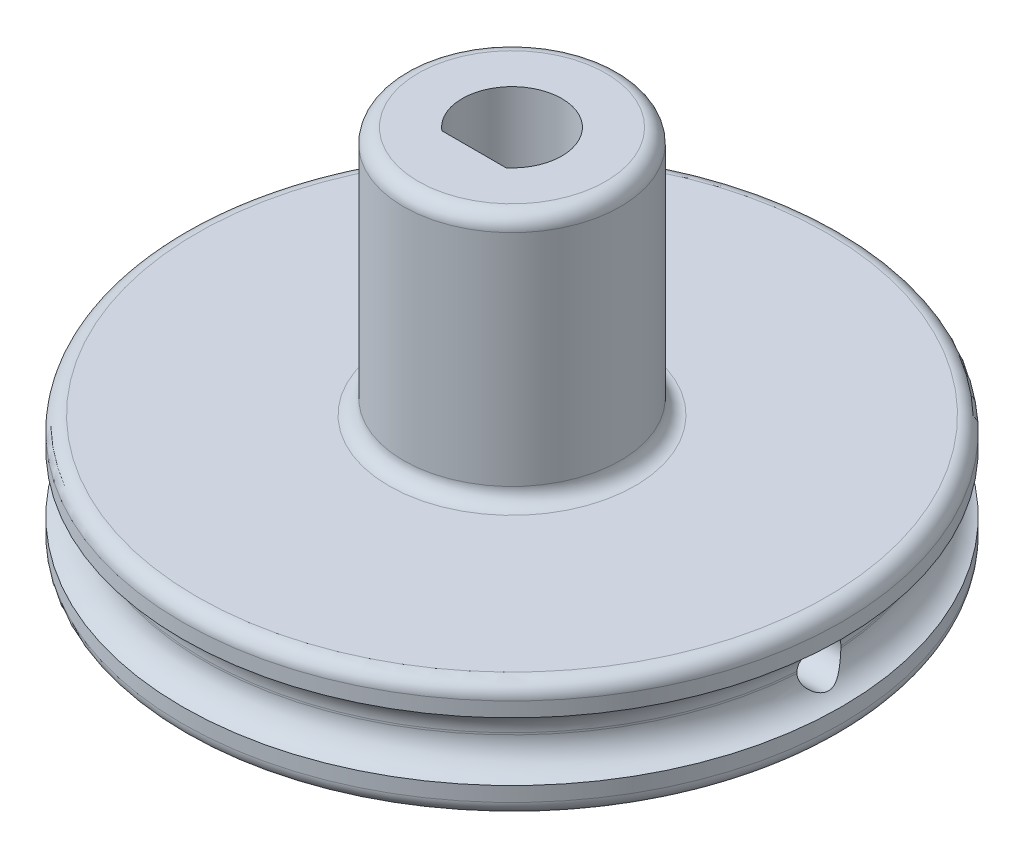
ISO-10303-21;
HEADER;
FILE_DESCRIPTION(('STEP AP214'),'2;1');
FILE_NAME('part.step','',(''),(''),'','','');
FILE_SCHEMA(('AUTOMOTIVE_DESIGN { 1 0 10303 214 1 1 1 1 }'));
ENDSEC;
DATA;
#1=APPLICATION_CONTEXT('core data for automotive mechanical design processes');
#2=APPLICATION_PROTOCOL_DEFINITION('international standard','automotive_design',2000,#1);
#3=PRODUCT_CONTEXT('',#1,'mechanical');
#4=PRODUCT('Part','Part','',(#3));
#5=PRODUCT_RELATED_PRODUCT_CATEGORY('part','',(#4));
#6=PRODUCT_DEFINITION_FORMATION('','',#4);
#7=PRODUCT_DEFINITION_CONTEXT('part definition',#1,'design');
#8=PRODUCT_DEFINITION('design','',#6,#7);
#9=PRODUCT_DEFINITION_SHAPE('','',#8);
#10=(LENGTH_UNIT() NAMED_UNIT(*) SI_UNIT(.MILLI.,.METRE.));
#11=(NAMED_UNIT(*) PLANE_ANGLE_UNIT() SI_UNIT($,.RADIAN.));
#12=(NAMED_UNIT(*) SI_UNIT($,.STERADIAN.) SOLID_ANGLE_UNIT());
#13=UNCERTAINTY_MEASURE_WITH_UNIT(LENGTH_MEASURE(1.E-05),#10,'distance_accuracy_value','');
#14=(GEOMETRIC_REPRESENTATION_CONTEXT(3) GLOBAL_UNCERTAINTY_ASSIGNED_CONTEXT((#13)) GLOBAL_UNIT_ASSIGNED_CONTEXT((#10,
#11,#12)) REPRESENTATION_CONTEXT('',''));
#15=CARTESIAN_POINT('',(0.,0.,0.));
#16=DIRECTION('',(0.,0.,1.));
#17=DIRECTION('',(1.,0.,0.));
#18=AXIS2_PLACEMENT_3D('',#15,#16,#17);
#19=CARTESIAN_POINT('',(0.,1.,0.));
#20=DIRECTION('',(0.,1.,0.));
#21=DIRECTION('',(0.,0.,1.));
#22=AXIS2_PLACEMENT_3D('',#19,#20,#21);
#23=CYLINDRICAL_SURFACE('',#22,10.5);
#24=CARTESIAN_POINT('',(10.5,1.25,0.));
#25=CARTESIAN_POINT('',(10.4999996459103,1.25000184599413,-0.0420702896906977));
#26=CARTESIAN_POINT('',(10.4997444551651,1.25355171822834,-0.0841697151823444));
#27=CARTESIAN_POINT('',(10.4987509831414,1.26766139121766,-0.167205182120869));
#28=CARTESIAN_POINT('',(10.498012145491,1.27822926546172,-0.208139826981758));
#29=CARTESIAN_POINT('',(10.4961349265712,1.30606904120026,-0.287631003955275));
#30=CARTESIAN_POINT('',(10.4949967621383,1.32333730488777,-0.326188813369015));
#31=CARTESIAN_POINT('',(10.4924487544025,1.36408153169771,-0.399848850525432));
#32=CARTESIAN_POINT('',(10.4910389717174,1.38755611017494,-0.434951846651903));
#33=CARTESIAN_POINT('',(10.4881030726537,1.44009542926148,-0.500782673246313));
#34=CARTESIAN_POINT('',(10.4865767636156,1.46916955424612,-0.531503006126405));
#35=CARTESIAN_POINT('',(10.4835814686867,1.53206306264146,-0.587632246842263));
#36=CARTESIAN_POINT('',(10.4821124852406,1.56588264814997,-0.613040928352703));
#37=CARTESIAN_POINT('',(10.4793959681773,1.63735098714617,-0.657849846643447));
#38=CARTESIAN_POINT('',(10.4781486713077,1.67500376758182,-0.67724367619479));
#39=CARTESIAN_POINT('',(10.4760187472181,1.7530415126039,-0.7094314113739));
#40=CARTESIAN_POINT('',(10.4751361150887,1.79342644040015,-0.722225405852854));
#41=CARTESIAN_POINT('',(10.4738369325609,1.87570839162719,-0.740829017574956));
#42=CARTESIAN_POINT('',(10.4734195824702,1.91760269248613,-0.746650619734161));
#43=CARTESIAN_POINT('',(10.4730956369413,2.00177576001648,-0.751181201960244));
#44=CARTESIAN_POINT('',(10.4731890342245,2.04405452120034,-0.749890283388113));
#45=CARTESIAN_POINT('',(10.4738753090453,2.12771452376762,-0.740242395612946));
#46=CARTESIAN_POINT('',(10.474467268304,2.16909727184382,-0.73189841702248));
#47=CARTESIAN_POINT('',(10.4760825183323,2.24987332351781,-0.708401426837434));
#48=CARTESIAN_POINT('',(10.47710581233,2.28926661222396,-0.693248364283407));
#49=CARTESIAN_POINT('',(10.4794694790249,2.36498712035384,-0.656548677846591));
#50=CARTESIAN_POINT('',(10.4808101424809,2.40131148652241,-0.634996186479635));
#51=CARTESIAN_POINT('',(10.4836571938165,2.46983183870472,-0.586113680368512));
#52=CARTESIAN_POINT('',(10.4851635841476,2.50202776363298,-0.558783580153214));
#53=CARTESIAN_POINT('',(10.4881764228053,2.56145287140962,-0.499048612415012));
#54=CARTESIAN_POINT('',(10.4896828636933,2.58867075958108,-0.466632507153405));
#55=CARTESIAN_POINT('',(10.4925228165297,2.63727997610893,-0.39768502342269));
#56=CARTESIAN_POINT('',(10.4938563283987,2.65867130178951,-0.361153643063687));
#57=CARTESIAN_POINT('',(10.4962003244408,2.69501931635249,-0.285005555863405));
#58=CARTESIAN_POINT('',(10.4972107857048,2.7099755489187,-0.245388630459512));
#59=CARTESIAN_POINT('',(10.4987945352409,2.73302113747236,-0.164197212882698));
#60=CARTESIAN_POINT('',(10.4993678301788,2.74111059816333,-0.122622750568214));
#61=CARTESIAN_POINT('',(10.5000117922214,2.75017895251046,-0.0387943631342636));
#62=CARTESIAN_POINT('',(10.500083562751,2.75117345617865,0.00345786522529639));
#63=CARTESIAN_POINT('',(10.4997193287321,2.74606449456017,0.0875285011581588));
#64=CARTESIAN_POINT('',(10.4992833276481,2.7399610777016,0.129346911689374));
#65=CARTESIAN_POINT('',(10.4979533231659,2.72084245885006,0.211318656604785));
#66=CARTESIAN_POINT('',(10.4970597962996,2.70783444775911,0.251473676535794));
#67=CARTESIAN_POINT('',(10.4949152049575,2.6752832091945,0.329030885913476));
#68=CARTESIAN_POINT('',(10.4936641362964,2.65573990521888,0.366433043128962));
#69=CARTESIAN_POINT('',(10.4909421529722,2.61063330617983,0.437494126946804));
#70=CARTESIAN_POINT('',(10.4894708604022,2.58505961862585,0.471146442137264));
#71=CARTESIAN_POINT('',(10.4864751699143,2.52863327692314,0.533685949062769));
#72=CARTESIAN_POINT('',(10.4849507713176,2.49778055525561,0.562573079841865));
#73=CARTESIAN_POINT('',(10.4820174518027,2.43160443775544,0.614815360932158));
#74=CARTESIAN_POINT('',(10.4806087458173,2.39627301779258,0.638160360675093));
#75=CARTESIAN_POINT('',(10.4780691343544,2.32218260558675,0.678586204627138));
#76=CARTESIAN_POINT('',(10.4769382267417,2.28342363969174,0.695667096984014));
#77=CARTESIAN_POINT('',(10.4750833134738,2.20361498876529,0.723062396609295));
#78=CARTESIAN_POINT('',(10.4743589278796,2.1625674822104,0.733383123502618));
#79=CARTESIAN_POINT('',(10.4733977069656,2.07931684901751,0.74698573941904));
#80=CARTESIAN_POINT('',(10.4731608650347,2.03711373805777,0.750267723889857));
#81=CARTESIAN_POINT('',(10.4732016044349,1.95285078494325,0.749698708386966));
#82=CARTESIAN_POINT('',(10.4734780352141,1.91079083357409,0.745863661958517));
#83=CARTESIAN_POINT('',(10.4745117313722,1.82791381916018,0.731202599756694));
#84=CARTESIAN_POINT('',(10.4752689975745,1.78709675824405,0.720376572011129));
#85=CARTESIAN_POINT('',(10.4771787426215,1.70786234680122,0.692044645056291));
#86=CARTESIAN_POINT('',(10.478331211915,1.66944493830711,0.674538907278669));
#87=CARTESIAN_POINT('',(10.4809014997491,1.5960920886772,0.633346462801262));
#88=CARTESIAN_POINT('',(10.4823193124875,1.56115657142927,0.609659891251878));
#89=CARTESIAN_POINT('',(10.4852642693368,1.49567786820655,0.556718578197045));
#90=CARTESIAN_POINT('',(10.4867916386566,1.46514414213574,0.527452149288891));
#91=CARTESIAN_POINT('',(10.4897816015316,1.40941154473007,0.464200561093081));
#92=CARTESIAN_POINT('',(10.4912441792185,1.38421397462793,0.430214254191139));
#93=CARTESIAN_POINT('',(10.4939417089127,1.33984450426722,0.358438546976615));
#94=CARTESIAN_POINT('',(10.4951763209639,1.32068157368202,0.320643594660229));
#95=CARTESIAN_POINT('',(10.4972745233087,1.28899744145457,0.242390654676055));
#96=CARTESIAN_POINT('',(10.4981385447485,1.27646851778678,0.201935825086028));
#97=CARTESIAN_POINT('',(10.4991736015175,1.26163871820478,0.134364084627482));
#98=CARTESIAN_POINT('',(10.4994821105472,1.25727990411502,0.107683123255775));
#99=CARTESIAN_POINT('',(10.4998954232599,1.25145995515487,0.0540054436549144));
#100=CARTESIAN_POINT('',(10.5000002273222,1.24999881488932,0.0270087260137571));
#101=CARTESIAN_POINT('',(10.5,1.25,0.));
#102=B_SPLINE_CURVE_WITH_KNOTS('',3,(#24,#25,#26,#27,#28,#29,#30,#31,#32,#33,#34,#35,#36,#37,
#38,#39,#40,#41,#42,#43,#44,#45,#46,#47,#48,#49,#50,#51,#52,#53,#54,#55,#56,#57,#58,#59,#60,#61,
#62,#63,#64,#65,#66,#67,#68,#69,#70,#71,#72,#73,#74,#75,#76,#77,#78,#79,#80,#81,#82,#83,#84,#85,
#86,#87,#88,#89,#90,#91,#92,#93,#94,#95,#96,#97,#98,#99,#100,#101),.UNSPECIFIED.,.T.,.F.,(4,2,2,
2,2,2,2,2,2,2,2,2,2,2,2,2,2,2,2,2,2,2,2,2,2,2,2,2,2,2,2,2,2,2,2,2,2,2,4),(0.,0.126112265961033,
0.252369863006392,0.378559007381876,0.504720022348824,0.631094342082059,0.757474045429571,
0.883987914066162,1.01050007944795,1.13679446823782,1.26308705720284,1.38914754092121,
1.51520896809682,1.64138633679889,1.76756557223815,1.89402763749129,2.02048976082097,
2.14696085017569,2.27343001108324,2.39962083405724,2.52581079605448,2.65186959258432,
2.77792986480653,2.90420899213916,3.03048973470147,3.15700000977925,3.28350931244157,
3.40990018061744,3.53628933487972,3.66239551721201,3.78850191550416,3.91460526631748,
4.04070585998008,4.1670735410398,4.29347200172802,4.42005745939435,4.54649524506669,
4.6274582715924,4.7084211473738),.UNSPECIFIED.);
#103=CARTESIAN_POINT('',(10.473228171242,1.96824583655185,-0.74932748054753));
#104=VERTEX_POINT('',#103);
#105=CARTESIAN_POINT('',(10.473228171242,2.03175416344815,-0.749327480547627));
#106=VERTEX_POINT('',#105);
#107=EDGE_CURVE('E171',#104,#106,#102,.T.);
#108=ORIENTED_EDGE('',*,*,#107,.F.);
#109=CARTESIAN_POINT('',(0.,1.96824583655185,0.));
#110=DIRECTION('',(0.,-1.,0.));
#111=DIRECTION('',(0.,0.,-1.));
#112=AXIS2_PLACEMENT_3D('',#109,#110,#111);
#113=CIRCLE('',#112,10.5);
#114=CARTESIAN_POINT('',(-10.473228171242,1.96824583655185,-0.749327480547627));
#115=VERTEX_POINT('',#114);
#116=EDGE_CURVE('E276',#104,#115,#113,.F.);
#117=ORIENTED_EDGE('',*,*,#116,.T.);
#118=CARTESIAN_POINT('',(-10.5,2.75,0.));
#119=CARTESIAN_POINT('',(-10.4999996459103,2.74999815400587,-0.0420702896906977));
#120=CARTESIAN_POINT('',(-10.4997444551651,2.74644828177166,-0.0841697151823444));
#121=CARTESIAN_POINT('',(-10.4987509831414,2.73233860878234,-0.167205182120869));
#122=CARTESIAN_POINT('',(-10.498012145491,2.72177073453828,-0.208139826981758));
#123=CARTESIAN_POINT('',(-10.4961349265712,2.69393095879974,-0.287631003955275));
#124=CARTESIAN_POINT('',(-10.4949967621383,2.67666269511223,-0.326188813369015));
#125=CARTESIAN_POINT('',(-10.4924487544025,2.63591846830229,-0.399848850525433));
#126=CARTESIAN_POINT('',(-10.4910389717174,2.61244388982507,-0.434951846651904));
#127=CARTESIAN_POINT('',(-10.4881030726537,2.55990457073852,-0.500782673246313));
#128=CARTESIAN_POINT('',(-10.4865767636156,2.53083044575388,-0.531503006126405));
#129=CARTESIAN_POINT('',(-10.4835814686867,2.46793693735854,-0.587632246842264));
#130=CARTESIAN_POINT('',(-10.4821124852406,2.43411735185003,-0.613040928352703));
#131=CARTESIAN_POINT('',(-10.4793959681773,2.36264901285383,-0.657849846643447));
#132=CARTESIAN_POINT('',(-10.4781486713077,2.32499623241818,-0.677243676194791));
#133=CARTESIAN_POINT('',(-10.4760187472181,2.2469584873961,-0.7094314113739));
#134=CARTESIAN_POINT('',(-10.4751361150887,2.20657355959985,-0.722225405852854));
#135=CARTESIAN_POINT('',(-10.4738369325609,2.12429160837281,-0.740829017574956));
#136=CARTESIAN_POINT('',(-10.4734195824702,2.08239730751387,-0.746650619734162));
#137=CARTESIAN_POINT('',(-10.4730956369413,1.99822423998352,-0.751181201960243));
#138=CARTESIAN_POINT('',(-10.4731890342245,1.95594547879966,-0.749890283388113));
#139=CARTESIAN_POINT('',(-10.4738753090453,1.87228547623238,-0.740242395612946));
#140=CARTESIAN_POINT('',(-10.474467268304,1.83090272815618,-0.73189841702248));
#141=CARTESIAN_POINT('',(-10.4760825183323,1.75012667648219,-0.708401426837434));
#142=CARTESIAN_POINT('',(-10.47710581233,1.71073338777604,-0.693248364283407));
#143=CARTESIAN_POINT('',(-10.4794694790249,1.63501287964616,-0.656548677846591));
#144=CARTESIAN_POINT('',(-10.4808101424809,1.59868851347759,-0.634996186479635));
#145=CARTESIAN_POINT('',(-10.4836571938165,1.53016816129528,-0.586113680368512));
#146=CARTESIAN_POINT('',(-10.4851635841476,1.49797223636702,-0.558783580153214));
#147=CARTESIAN_POINT('',(-10.4881764228053,1.43854712859038,-0.499048612415011));
#148=CARTESIAN_POINT('',(-10.4896828636933,1.41132924041892,-0.466632507153404));
#149=CARTESIAN_POINT('',(-10.4925228165297,1.36272002389107,-0.397685023422689));
#150=CARTESIAN_POINT('',(-10.4938563283987,1.34132869821049,-0.361153643063687));
#151=CARTESIAN_POINT('',(-10.4962003244408,1.30498068364751,-0.285005555863404));
#152=CARTESIAN_POINT('',(-10.4972107857048,1.2900244510813,-0.245388630459511));
#153=CARTESIAN_POINT('',(-10.4987945352409,1.26697886252765,-0.164197212882697));
#154=CARTESIAN_POINT('',(-10.4993678301788,1.25888940183667,-0.122622750568213));
#155=CARTESIAN_POINT('',(-10.5000117922214,1.24982104748954,-0.0387943631342629));
#156=CARTESIAN_POINT('',(-10.500083562751,1.24882654382135,0.00345786522529706));
#157=CARTESIAN_POINT('',(-10.4997193287321,1.25393550543983,0.0875285011581595));
#158=CARTESIAN_POINT('',(-10.4992833276481,1.2600389222984,0.129346911689374));
#159=CARTESIAN_POINT('',(-10.4979533231659,1.27915754114994,0.211318656604786));
#160=CARTESIAN_POINT('',(-10.4970597962996,1.29216555224089,0.251473676535795));
#161=CARTESIAN_POINT('',(-10.4949152049575,1.3247167908055,0.329030885913477));
#162=CARTESIAN_POINT('',(-10.4936641362964,1.34426009478112,0.366433043128963));
#163=CARTESIAN_POINT('',(-10.4909421529722,1.38936669382017,0.437494126946805));
#164=CARTESIAN_POINT('',(-10.4894708604022,1.41494038137415,0.471146442137264));
#165=CARTESIAN_POINT('',(-10.4864751699143,1.47136672307686,0.533685949062769));
#166=CARTESIAN_POINT('',(-10.4849507713176,1.50221944474439,0.562573079841865));
#167=CARTESIAN_POINT('',(-10.4820174518027,1.56839556224456,0.614815360932158));
#168=CARTESIAN_POINT('',(-10.4806087458173,1.60372698220742,0.638160360675093));
#169=CARTESIAN_POINT('',(-10.4780691343544,1.67781739441326,0.678586204627138));
#170=CARTESIAN_POINT('',(-10.4769382267417,1.71657636030826,0.695667096984014));
#171=CARTESIAN_POINT('',(-10.4750833134738,1.79638501123471,0.723062396609295));
#172=CARTESIAN_POINT('',(-10.4743589278796,1.8374325177896,0.733383123502618));
#173=CARTESIAN_POINT('',(-10.4733977069656,1.92068315098249,0.74698573941904));
#174=CARTESIAN_POINT('',(-10.4731608650347,1.96288626194223,0.750267723889857));
#175=CARTESIAN_POINT('',(-10.4732016044349,2.04714921505675,0.749698708386966));
#176=CARTESIAN_POINT('',(-10.4734780352141,2.08920916642592,0.745863661958517));
#177=CARTESIAN_POINT('',(-10.4745117313722,2.17208618083982,0.731202599756693));
#178=CARTESIAN_POINT('',(-10.4752689975745,2.21290324175595,0.720376572011129));
#179=CARTESIAN_POINT('',(-10.4771787426215,2.29213765319878,0.692044645056291));
#180=CARTESIAN_POINT('',(-10.478331211915,2.33055506169289,0.674538907278668));
#181=CARTESIAN_POINT('',(-10.4809014997491,2.4039079113228,0.633346462801262));
#182=CARTESIAN_POINT('',(-10.4823193124875,2.43884342857073,0.609659891251878));
#183=CARTESIAN_POINT('',(-10.4852642693368,2.50432213179345,0.556718578197044));
#184=CARTESIAN_POINT('',(-10.4867916386566,2.53485585786426,0.527452149288891));
#185=CARTESIAN_POINT('',(-10.4897816015316,2.59058845526993,0.464200561093081));
#186=CARTESIAN_POINT('',(-10.4912441792185,2.61578602537207,0.430214254191138));
#187=CARTESIAN_POINT('',(-10.4939417089127,2.66015549573278,0.358438546976614));
#188=CARTESIAN_POINT('',(-10.4951763209639,2.67931842631798,0.320643594660229));
#189=CARTESIAN_POINT('',(-10.4972745233087,2.71100255854543,0.242390654676054));
#190=CARTESIAN_POINT('',(-10.4981385447485,2.72353148221322,0.201935825086028));
#191=CARTESIAN_POINT('',(-10.4991736015175,2.73836128179522,0.134364084627481));
#192=CARTESIAN_POINT('',(-10.4994821105472,2.74272009588498,0.107683123255775));
#193=CARTESIAN_POINT('',(-10.4998954232599,2.74854004484513,0.0540054436549143));
#194=CARTESIAN_POINT('',(-10.5000002273222,2.75000118511068,0.027008726013757));
#195=CARTESIAN_POINT('',(-10.5,2.75,0.));
#196=B_SPLINE_CURVE_WITH_KNOTS('',3,(#118,#119,#120,#121,#122,#123,#124,#125,#126,#127,#128,
#129,#130,#131,#132,#133,#134,#135,#136,#137,#138,#139,#140,#141,#142,#143,#144,#145,#146,#147,
#148,#149,#150,#151,#152,#153,#154,#155,#156,#157,#158,#159,#160,#161,#162,#163,#164,#165,#166,
#167,#168,#169,#170,#171,#172,#173,#174,#175,#176,#177,#178,#179,#180,#181,#182,#183,#184,#185,
#186,#187,#188,#189,#190,#191,#192,#193,#194,#195),.UNSPECIFIED.,.T.,.F.,(4,2,2,2,2,2,2,2,2,2,2,
2,2,2,2,2,2,2,2,2,2,2,2,2,2,2,2,2,2,2,2,2,2,2,2,2,2,2,4),(0.,0.126112265961033,
0.252369863006392,0.378559007381876,0.504720022348824,0.631094342082059,0.757474045429571,
0.883987914066162,1.01050007944795,1.13679446823782,1.26308705720284,1.38914754092121,
1.51520896809682,1.64138633679889,1.76756557223815,1.89402763749129,2.02048976082097,
2.14696085017569,2.27343001108324,2.39962083405724,2.52581079605448,2.65186959258432,
2.77792986480653,2.90420899213916,3.03048973470147,3.15700000977925,3.28350931244157,
3.40990018061744,3.53628933487972,3.66239551721201,3.78850191550416,3.91460526631748,
4.04070585998008,4.1670735410398,4.29347200172802,4.42005745939435,4.54649524506669,
4.6274582715924,4.7084211473738),.UNSPECIFIED.);
#197=CARTESIAN_POINT('',(-10.473228171242,2.03175416344814,-0.74932748054753));
#198=VERTEX_POINT('',#197);
#199=EDGE_CURVE('E150',#198,#115,#196,.T.);
#200=ORIENTED_EDGE('',*,*,#199,.F.);
#201=CARTESIAN_POINT('',(0.,2.03175416344815,0.));
#202=DIRECTION('',(0.,1.,0.));
#203=DIRECTION('',(0.,0.,1.));
#204=AXIS2_PLACEMENT_3D('',#201,#202,#203);
#205=CIRCLE('',#204,10.5);
#206=EDGE_CURVE('E272',#198,#106,#205,.F.);
#207=ORIENTED_EDGE('',*,*,#206,.T.);
#208=EDGE_LOOP('',(#108,#117,#200,#207));
#209=FACE_BOUND('',#208,.T.);
#210=ADVANCED_FACE('F67',(#209),#23,.T.);
#211=CARTESIAN_POINT('',(0.,4.,0.));
#212=DIRECTION('',(0.,-1.,0.));
#213=DIRECTION('',(0.,0.,-1.));
#214=AXIS2_PLACEMENT_3D('',#211,#212,#213);
#215=CYLINDRICAL_SURFACE('',#214,11.25);
#216=CARTESIAN_POINT('',(0.,0.5,0.));
#217=DIRECTION('',(0.,1.,0.));
#218=DIRECTION('',(0.,0.,1.));
#219=AXIS2_PLACEMENT_3D('',#216,#217,#218);
#220=CIRCLE('',#219,11.25);
#221=CARTESIAN_POINT('',(0.,0.5,11.25));
#222=VERTEX_POINT('',#221);
#223=EDGE_CURVE('E246',#222,#222,#220,.T.);
#224=ORIENTED_EDGE('',*,*,#223,.T.);
#225=EDGE_LOOP('',(#224));
#226=FACE_BOUND('',#225,.T.);
#227=CARTESIAN_POINT('',(0.,1.,0.));
#228=DIRECTION('',(0.,1.,0.));
#229=DIRECTION('',(0.,0.,1.));
#230=AXIS2_PLACEMENT_3D('',#227,#228,#229);
#231=CIRCLE('',#230,11.25);
#232=CARTESIAN_POINT('',(0.,1.,11.25));
#233=VERTEX_POINT('',#232);
#234=EDGE_CURVE('E266',#233,#233,#231,.T.);
#235=ORIENTED_EDGE('',*,*,#234,.F.);
#236=EDGE_LOOP('',(#235));
#237=FACE_BOUND('',#236,.T.);
#238=ADVANCED_FACE('F184',(#226,#237),#215,.T.);
#239=CARTESIAN_POINT('',(12.5,2.,0.));
#240=DIRECTION('',(-1.,0.,0.));
#241=DIRECTION('',(0.,-1.,0.));
#242=AXIS2_PLACEMENT_3D('',#239,#240,#241);
#243=CYLINDRICAL_SURFACE('',#242,0.750000000000001);
#244=CARTESIAN_POINT('',(9.13677438108973,2.,0.));
#245=DIRECTION('',(1.,0.,0.));
#246=DIRECTION('',(0.,0.,1.));
#247=AXIS2_PLACEMENT_3D('',#244,#245,#246);
#248=CIRCLE('',#247,0.750000000000001);
#249=CARTESIAN_POINT('',(9.13677438108973,2.75,0.));
#250=VERTEX_POINT('',#249);
#251=EDGE_CURVE('E142',#250,#250,#248,.T.);
#252=ORIENTED_EDGE('',*,*,#251,.F.);
#253=EDGE_LOOP('',(#252));
#254=FACE_BOUND('',#253,.T.);
#255=ORIENTED_EDGE('',*,*,#107,.T.);
#256=CARTESIAN_POINT('',(10.473228171242,2.03175416344814,-0.74932748054753));
#257=CARTESIAN_POINT('',(10.4732806037205,2.05001902725032,-0.74855561269119));
#258=CARTESIAN_POINT('',(10.4738887687864,2.06824200255767,-0.747111744595877));
#259=CARTESIAN_POINT('',(10.4761734237488,2.10445370077412,-0.742913823979604));
#260=CARTESIAN_POINT('',(10.4778490154327,2.12244260767149,-0.740160873511891));
#261=CARTESIAN_POINT('',(10.4843763784667,2.17557344460293,-0.730043538900081));
#262=CARTESIAN_POINT('',(10.490731246567,2.21019708904105,-0.720806139207487));
#263=CARTESIAN_POINT('',(10.5067765620968,2.2769404781224,-0.697889379802058));
#264=CARTESIAN_POINT('',(10.5164570103892,2.30906737873837,-0.684223342730422));
#265=CARTESIAN_POINT('',(10.538361973745,2.37048567725323,-0.65301547359613));
#266=CARTESIAN_POINT('',(10.5505908112121,2.39977213208269,-0.635467053342104));
#267=CARTESIAN_POINT('',(10.5782059383724,2.45826625765154,-0.594892396799979));
#268=CARTESIAN_POINT('',(10.5937919225371,2.48710598517338,-0.571474732895549));
#269=CARTESIAN_POINT('',(10.625975449341,2.54078765138728,-0.520969626270178));
#270=CARTESIAN_POINT('',(10.6425746130133,2.56562293910419,-0.49387621314159));
#271=CARTESIAN_POINT('',(10.6791803168864,2.6160483256704,-0.430091989709004));
#272=CARTESIAN_POINT('',(10.6991504544089,2.6406481993613,-0.392591066986179));
#273=CARTESIAN_POINT('',(10.7363154000212,2.68317718981096,-0.312736079103994));
#274=CARTESIAN_POINT('',(10.7535169057677,2.70112254622764,-0.270394163052405));
#275=CARTESIAN_POINT('',(10.7765044162783,2.72404983306205,-0.197777717832519));
#276=CARTESIAN_POINT('',(10.7841588500075,2.7313714092633,-0.168841006129399));
#277=CARTESIAN_POINT('',(10.7960403660927,2.74254991872326,-0.109647652311246));
#278=CARTESIAN_POINT('',(10.8002747993197,2.7464142847676,-0.0793939892317464));
#279=CARTESIAN_POINT('',(10.8046560344002,2.75041061633329,-0.0181520491874947));
#280=CARTESIAN_POINT('',(10.8047789486244,2.75052077022226,0.0128394742264242));
#281=CARTESIAN_POINT('',(10.8008533228309,2.74694333229991,0.0743457660983718));
#282=CARTESIAN_POINT('',(10.7968005290056,2.74325186776919,0.104860016178562));
#283=CARTESIAN_POINT('',(10.7841993292165,2.73142265922481,0.169662372141584));
#284=CARTESIAN_POINT('',(10.7749986794703,2.72263049369777,0.203699235075611));
#285=CARTESIAN_POINT('',(10.7533440670678,2.70083762631143,0.269310846406631));
#286=CARTESIAN_POINT('',(10.7408824291916,2.68782697812368,0.300879554884404));
#287=CARTESIAN_POINT('',(10.7094232641402,2.65281839242606,0.372033869214088));
#288=CARTESIAN_POINT('',(10.6896708400859,2.62926913728728,0.410519231652818));
#289=CARTESIAN_POINT('',(10.6495246067262,2.5759147796019,0.482527087968066));
#290=CARTESIAN_POINT('',(10.62913000721,2.54610169137252,0.51604315260878));
#291=CARTESIAN_POINT('',(10.5895930252779,2.48004828044414,0.578039348308694));
#292=CARTESIAN_POINT('',(10.5704688209865,2.44373442140037,0.60645350244673));
#293=CARTESIAN_POINT('',(10.5359048820793,2.36527464127877,0.656679273565678));
#294=CARTESIAN_POINT('',(10.520455288977,2.3231448153939,0.678508600000654));
#295=CARTESIAN_POINT('',(10.4991717647801,2.24764371033194,0.708722928399011));
#296=CARTESIAN_POINT('',(10.4918422985029,2.21551643615107,0.719177746592552));
#297=CARTESIAN_POINT('',(10.4806309131238,2.14962080893195,0.735701918150447));
#298=CARTESIAN_POINT('',(10.4767398606866,2.11585705630917,0.741782881575987));
#299=CARTESIAN_POINT('',(10.4737856173396,2.06514819811267,0.74735588378033));
#300=CARTESIAN_POINT('',(10.4732697153668,2.04846117912715,0.74862772924685));
#301=CARTESIAN_POINT('',(10.473228171242,2.03175416344814,0.74932748054753));
#302=B_SPLINE_CURVE_WITH_KNOTS('',3,(#256,#257,#258,#259,#260,#261,#262,#263,#264,#265,#266,
#267,#268,#269,#270,#271,#272,#273,#274,#275,#276,#277,#278,#279,#280,#281,#282,#283,#284,#285,
#286,#287,#288,#289,#290,#291,#292,#293,#294,#295,#296,#297,#298,#299,#300,#301),.UNSPECIFIED.,
.F.,.F.,(4,2,2,2,2,2,2,2,2,2,2,2,2,2,2,2,2,2,2,2,2,2,4),(0.,0.0548012624026914,
0.109556471724453,0.218127706367813,0.326375312577097,0.434808037537853,0.555249736951669,
0.675889462064557,0.822521348090419,0.96879300179728,1.0608975416616,1.15280358332027,
1.24524350028215,1.33777767928758,1.4461948240455,1.55486947638167,1.70187933090936,
1.84907775624351,1.99806068164263,2.14663927983346,2.24993444765413,2.35295440423366,
2.40312235157218),.UNSPECIFIED.);
#303=CARTESIAN_POINT('',(10.473228171242,2.03175416344814,0.749327480547532));
#304=VERTEX_POINT('',#303);
#305=EDGE_CURVE('E199',#106,#304,#302,.T.);
#306=ORIENTED_EDGE('',*,*,#305,.T.);
#307=CARTESIAN_POINT('',(10.473228171242,1.96824583655185,0.74932748054753));
#308=VERTEX_POINT('',#307);
#309=EDGE_CURVE('E157',#304,#308,#102,.T.);
#310=ORIENTED_EDGE('',*,*,#309,.T.);
#311=CARTESIAN_POINT('',(10.473228171242,1.96824583655185,0.74932748054753));
#312=CARTESIAN_POINT('',(10.4732806037205,1.94998097274967,0.74855561269119));
#313=CARTESIAN_POINT('',(10.4738887687864,1.93175799744233,0.747111744595877));
#314=CARTESIAN_POINT('',(10.4761734237488,1.89554629922588,0.742913823979604));
#315=CARTESIAN_POINT('',(10.4778490154327,1.87755739232851,0.740160873511891));
#316=CARTESIAN_POINT('',(10.4843763784667,1.82442655539706,0.73004353890008));
#317=CARTESIAN_POINT('',(10.490731246567,1.78980291095895,0.720806139207486));
#318=CARTESIAN_POINT('',(10.5067765620968,1.7230595218776,0.697889379802057));
#319=CARTESIAN_POINT('',(10.5164570103892,1.69093262126163,0.68422334273042));
#320=CARTESIAN_POINT('',(10.538361973745,1.62951432274677,0.653015473596129));
#321=CARTESIAN_POINT('',(10.5505908112121,1.60022786791731,0.635467053342102));
#322=CARTESIAN_POINT('',(10.5782059383724,1.54173374234846,0.594892396799976));
#323=CARTESIAN_POINT('',(10.5937919225371,1.51289401482662,0.571474732895546));
#324=CARTESIAN_POINT('',(10.625975449341,1.45921234861272,0.520969626270175));
#325=CARTESIAN_POINT('',(10.6425746130133,1.43437706089581,0.493876213141588));
#326=CARTESIAN_POINT('',(10.6791803168864,1.3839516743296,0.430091989709));
#327=CARTESIAN_POINT('',(10.6991504544089,1.3593518006387,0.392591066986174));
#328=CARTESIAN_POINT('',(10.7363154000212,1.31682281018904,0.312736079103988));
#329=CARTESIAN_POINT('',(10.7535169057677,1.29887745377236,0.2703941630524));
#330=CARTESIAN_POINT('',(10.7765044162783,1.27595016693795,0.197777717832515));
#331=CARTESIAN_POINT('',(10.7841588500075,1.2686285907367,0.168841006129395));
#332=CARTESIAN_POINT('',(10.7960403660927,1.25745008127674,0.109647652311241));
#333=CARTESIAN_POINT('',(10.8002747993197,1.2535857152324,0.0793939892317419));
#334=CARTESIAN_POINT('',(10.8046560344002,1.24958938366671,0.0181520491874901));
#335=CARTESIAN_POINT('',(10.8047789486244,1.24947922977774,-0.0128394742264287));
#336=CARTESIAN_POINT('',(10.8008533228309,1.25305666770009,-0.0743457660983763));
#337=CARTESIAN_POINT('',(10.7968005290056,1.25674813223081,-0.104860016178567));
#338=CARTESIAN_POINT('',(10.7841993292165,1.26857734077519,-0.169662372141589));
#339=CARTESIAN_POINT('',(10.7749986794703,1.27736950630223,-0.203699235075616));
#340=CARTESIAN_POINT('',(10.7533440670678,1.29916237368858,-0.269310846406636));
#341=CARTESIAN_POINT('',(10.7408824291916,1.31217302187633,-0.300879554884409));
#342=CARTESIAN_POINT('',(10.7094232641402,1.34718160757394,-0.372033869214093));
#343=CARTESIAN_POINT('',(10.6896708400859,1.37073086271272,-0.410519231652823));
#344=CARTESIAN_POINT('',(10.6495246067262,1.4240852203981,-0.482527087968071));
#345=CARTESIAN_POINT('',(10.62913000721,1.45389830862748,-0.516043152608784));
#346=CARTESIAN_POINT('',(10.5895930252779,1.51995171955586,-0.578039348308698));
#347=CARTESIAN_POINT('',(10.5704688209865,1.55626557859964,-0.606453502446734));
#348=CARTESIAN_POINT('',(10.5359048820793,1.63472535872124,-0.656679273565682));
#349=CARTESIAN_POINT('',(10.520455288977,1.6768551846061,-0.678508600000657));
#350=CARTESIAN_POINT('',(10.4991717647801,1.75235628966807,-0.708722928399014));
#351=CARTESIAN_POINT('',(10.4918422985029,1.78448356384894,-0.719177746592555));
#352=CARTESIAN_POINT('',(10.4806309131238,1.85037919106805,-0.735701918150449));
#353=CARTESIAN_POINT('',(10.4767398606866,1.88414294369084,-0.741782881575988));
#354=CARTESIAN_POINT('',(10.4737856173396,1.93485180188734,-0.74735588378033));
#355=CARTESIAN_POINT('',(10.4732697153668,1.95153882087285,-0.748627729246849));
#356=CARTESIAN_POINT('',(10.473228171242,1.96824583655185,-0.74932748054753));
#357=B_SPLINE_CURVE_WITH_KNOTS('',3,(#311,#312,#313,#314,#315,#316,#317,#318,#319,#320,#321,
#322,#323,#324,#325,#326,#327,#328,#329,#330,#331,#332,#333,#334,#335,#336,#337,#338,#339,#340,
#341,#342,#343,#344,#345,#346,#347,#348,#349,#350,#351,#352,#353,#354,#355,#356),.UNSPECIFIED.,
.F.,.F.,(4,2,2,2,2,2,2,2,2,2,2,2,2,2,2,2,2,2,2,2,2,2,4),(0.,0.0548012624026913,
0.109556471724453,0.218127706367814,0.326375312577098,0.434808037537854,0.55524973695167,
0.675889462064559,0.822521348090423,0.968793001797281,1.0608975416616,1.15280358332028,
1.24524350028215,1.33777767928758,1.4461948240455,1.55486947638167,1.70187933090937,
1.84907775624352,1.99806068164263,2.14663927983347,2.24993444765414,2.35295440423366,
2.40312235157217),.UNSPECIFIED.);
#358=EDGE_CURVE('E192',#308,#104,#357,.T.);
#359=ORIENTED_EDGE('',*,*,#358,.T.);
#360=EDGE_LOOP('',(#255,#306,#310,#359));
#361=FACE_BOUND('',#360,.T.);
#362=ADVANCED_FACE('F180',(#254,#361),#243,.F.);
#363=CARTESIAN_POINT('',(-12.5,2.,0.));
#364=DIRECTION('',(1.,0.,0.));
#365=DIRECTION('',(0.,1.,0.));
#366=AXIS2_PLACEMENT_3D('',#363,#364,#365);
#367=CYLINDRICAL_SURFACE('',#366,0.750000000000001);
#368=CARTESIAN_POINT('',(-9.13677438108973,2.,0.));
#369=DIRECTION('',(1.,0.,0.));
#370=DIRECTION('',(0.,0.,1.));
#371=AXIS2_PLACEMENT_3D('',#368,#369,#370);
#372=CIRCLE('',#371,0.750000000000001);
#373=CARTESIAN_POINT('',(-9.13677438108973,2.75,0.));
#374=VERTEX_POINT('',#373);
#375=EDGE_CURVE('E178',#374,#374,#372,.F.);
#376=ORIENTED_EDGE('',*,*,#375,.F.);
#377=EDGE_LOOP('',(#376));
#378=FACE_BOUND('',#377,.T.);
#379=ORIENTED_EDGE('',*,*,#199,.T.);
#380=CARTESIAN_POINT('',(-10.473228171242,1.96824583655185,-0.74932748054753));
#381=CARTESIAN_POINT('',(-10.4732806037205,1.94998097274967,-0.74855561269119));
#382=CARTESIAN_POINT('',(-10.4738887687864,1.93175799744233,-0.747111744595877));
#383=CARTESIAN_POINT('',(-10.4761734237488,1.89554629922588,-0.742913823979604));
#384=CARTESIAN_POINT('',(-10.4778490154327,1.87755739232851,-0.740160873511891));
#385=CARTESIAN_POINT('',(-10.4843763784667,1.82442655539706,-0.73004353890008));
#386=CARTESIAN_POINT('',(-10.490731246567,1.78980291095895,-0.720806139207486));
#387=CARTESIAN_POINT('',(-10.5067765620968,1.7230595218776,-0.697889379802057));
#388=CARTESIAN_POINT('',(-10.5164570103892,1.69093262126163,-0.68422334273042));
#389=CARTESIAN_POINT('',(-10.538361973745,1.62951432274677,-0.653015473596129));
#390=CARTESIAN_POINT('',(-10.5505908112121,1.60022786791731,-0.635467053342102));
#391=CARTESIAN_POINT('',(-10.5782059383724,1.54173374234846,-0.594892396799976));
#392=CARTESIAN_POINT('',(-10.5937919225371,1.51289401482662,-0.571474732895546));
#393=CARTESIAN_POINT('',(-10.625975449341,1.45921234861272,-0.520969626270175));
#394=CARTESIAN_POINT('',(-10.6425746130133,1.43437706089581,-0.493876213141588));
#395=CARTESIAN_POINT('',(-10.6791803168864,1.3839516743296,-0.430091989709));
#396=CARTESIAN_POINT('',(-10.6991504544089,1.3593518006387,-0.392591066986174));
#397=CARTESIAN_POINT('',(-10.7363154000212,1.31682281018904,-0.312736079103988));
#398=CARTESIAN_POINT('',(-10.7535169057677,1.29887745377236,-0.2703941630524));
#399=CARTESIAN_POINT('',(-10.7765044162783,1.27595016693795,-0.197777717832515));
#400=CARTESIAN_POINT('',(-10.7841588500075,1.2686285907367,-0.168841006129395));
#401=CARTESIAN_POINT('',(-10.7960403660927,1.25745008127674,-0.109647652311241));
#402=CARTESIAN_POINT('',(-10.8002747993197,1.2535857152324,-0.0793939892317419));
#403=CARTESIAN_POINT('',(-10.8046560344002,1.24958938366671,-0.0181520491874901));
#404=CARTESIAN_POINT('',(-10.8047789486244,1.24947922977774,0.0128394742264287));
#405=CARTESIAN_POINT('',(-10.8008533228309,1.25305666770009,0.0743457660983763));
#406=CARTESIAN_POINT('',(-10.7968005290056,1.25674813223081,0.104860016178567));
#407=CARTESIAN_POINT('',(-10.7841993292165,1.26857734077519,0.169662372141589));
#408=CARTESIAN_POINT('',(-10.7749986794703,1.27736950630223,0.203699235075616));
#409=CARTESIAN_POINT('',(-10.7533440670678,1.29916237368858,0.269310846406636));
#410=CARTESIAN_POINT('',(-10.7408824291916,1.31217302187633,0.300879554884409));
#411=CARTESIAN_POINT('',(-10.7094232641402,1.34718160757394,0.372033869214093));
#412=CARTESIAN_POINT('',(-10.6896708400859,1.37073086271272,0.410519231652823));
#413=CARTESIAN_POINT('',(-10.6495246067262,1.4240852203981,0.482527087968071));
#414=CARTESIAN_POINT('',(-10.62913000721,1.45389830862748,0.516043152608784));
#415=CARTESIAN_POINT('',(-10.5895930252779,1.51995171955586,0.578039348308698));
#416=CARTESIAN_POINT('',(-10.5704688209865,1.55626557859964,0.606453502446734));
#417=CARTESIAN_POINT('',(-10.5359048820793,1.63472535872124,0.656679273565682));
#418=CARTESIAN_POINT('',(-10.520455288977,1.6768551846061,0.678508600000657));
#419=CARTESIAN_POINT('',(-10.4991717647801,1.75235628966807,0.708722928399014));
#420=CARTESIAN_POINT('',(-10.4918422985029,1.78448356384894,0.719177746592555));
#421=CARTESIAN_POINT('',(-10.4806309131238,1.85037919106805,0.735701918150449));
#422=CARTESIAN_POINT('',(-10.4767398606866,1.88414294369084,0.741782881575988));
#423=CARTESIAN_POINT('',(-10.4737856173396,1.93485180188734,0.74735588378033));
#424=CARTESIAN_POINT('',(-10.4732697153668,1.95153882087285,0.748627729246849));
#425=CARTESIAN_POINT('',(-10.473228171242,1.96824583655185,0.74932748054753));
#426=B_SPLINE_CURVE_WITH_KNOTS('',3,(#380,#381,#382,#383,#384,#385,#386,#387,#388,#389,#390,
#391,#392,#393,#394,#395,#396,#397,#398,#399,#400,#401,#402,#403,#404,#405,#406,#407,#408,#409,
#410,#411,#412,#413,#414,#415,#416,#417,#418,#419,#420,#421,#422,#423,#424,#425),.UNSPECIFIED.,
.F.,.F.,(4,2,2,2,2,2,2,2,2,2,2,2,2,2,2,2,2,2,2,2,2,2,4),(0.,0.0548012624026913,
0.109556471724453,0.218127706367814,0.326375312577098,0.434808037537854,0.55524973695167,
0.675889462064559,0.822521348090423,0.968793001797281,1.0608975416616,1.15280358332028,
1.24524350028215,1.33777767928758,1.4461948240455,1.55486947638167,1.70187933090937,
1.84907775624352,1.99806068164263,2.14663927983347,2.24993444765414,2.35295440423366,
2.40312235157217),.UNSPECIFIED.);
#427=CARTESIAN_POINT('',(-10.473228171242,1.96824583655185,0.749327480547532));
#428=VERTEX_POINT('',#427);
#429=EDGE_CURVE('E89',#115,#428,#426,.T.);
#430=ORIENTED_EDGE('',*,*,#429,.T.);
#431=CARTESIAN_POINT('',(-10.473228171242,2.03175416344814,0.749327480547531));
#432=VERTEX_POINT('',#431);
#433=EDGE_CURVE('E158',#428,#432,#196,.T.);
#434=ORIENTED_EDGE('',*,*,#433,.T.);
#435=CARTESIAN_POINT('',(-10.473228171242,2.03175416344814,0.74932748054753));
#436=CARTESIAN_POINT('',(-10.4732806037205,2.05001902725032,0.74855561269119));
#437=CARTESIAN_POINT('',(-10.4738887687864,2.06824200255767,0.747111744595877));
#438=CARTESIAN_POINT('',(-10.4761734237488,2.10445370077412,0.742913823979604));
#439=CARTESIAN_POINT('',(-10.4778490154327,2.12244260767149,0.740160873511891));
#440=CARTESIAN_POINT('',(-10.4843763784667,2.17557344460293,0.730043538900081));
#441=CARTESIAN_POINT('',(-10.490731246567,2.21019708904105,0.720806139207487));
#442=CARTESIAN_POINT('',(-10.5067765620968,2.2769404781224,0.697889379802058));
#443=CARTESIAN_POINT('',(-10.5164570103892,2.30906737873837,0.684223342730422));
#444=CARTESIAN_POINT('',(-10.538361973745,2.37048567725323,0.65301547359613));
#445=CARTESIAN_POINT('',(-10.5505908112121,2.39977213208269,0.635467053342104));
#446=CARTESIAN_POINT('',(-10.5782059383724,2.45826625765154,0.594892396799979));
#447=CARTESIAN_POINT('',(-10.5937919225371,2.48710598517338,0.571474732895549));
#448=CARTESIAN_POINT('',(-10.625975449341,2.54078765138728,0.520969626270178));
#449=CARTESIAN_POINT('',(-10.6425746130133,2.56562293910419,0.49387621314159));
#450=CARTESIAN_POINT('',(-10.6791803168864,2.6160483256704,0.430091989709004));
#451=CARTESIAN_POINT('',(-10.6991504544089,2.6406481993613,0.392591066986179));
#452=CARTESIAN_POINT('',(-10.7363154000212,2.68317718981096,0.312736079103994));
#453=CARTESIAN_POINT('',(-10.7535169057677,2.70112254622764,0.270394163052405));
#454=CARTESIAN_POINT('',(-10.7765044162783,2.72404983306205,0.197777717832519));
#455=CARTESIAN_POINT('',(-10.7841588500075,2.7313714092633,0.168841006129399));
#456=CARTESIAN_POINT('',(-10.7960403660927,2.74254991872326,0.109647652311246));
#457=CARTESIAN_POINT('',(-10.8002747993197,2.7464142847676,0.0793939892317464));
#458=CARTESIAN_POINT('',(-10.8046560344002,2.75041061633329,0.0181520491874947));
#459=CARTESIAN_POINT('',(-10.8047789486244,2.75052077022226,-0.0128394742264242));
#460=CARTESIAN_POINT('',(-10.8008533228309,2.74694333229991,-0.0743457660983718));
#461=CARTESIAN_POINT('',(-10.7968005290056,2.74325186776919,-0.104860016178562));
#462=CARTESIAN_POINT('',(-10.7841993292165,2.73142265922481,-0.169662372141584));
#463=CARTESIAN_POINT('',(-10.7749986794703,2.72263049369777,-0.203699235075611));
#464=CARTESIAN_POINT('',(-10.7533440670678,2.70083762631143,-0.269310846406631));
#465=CARTESIAN_POINT('',(-10.7408824291916,2.68782697812368,-0.300879554884404));
#466=CARTESIAN_POINT('',(-10.7094232641402,2.65281839242606,-0.372033869214088));
#467=CARTESIAN_POINT('',(-10.6896708400859,2.62926913728728,-0.410519231652818));
#468=CARTESIAN_POINT('',(-10.6495246067262,2.5759147796019,-0.482527087968066));
#469=CARTESIAN_POINT('',(-10.62913000721,2.54610169137252,-0.51604315260878));
#470=CARTESIAN_POINT('',(-10.5895930252779,2.48004828044414,-0.578039348308694));
#471=CARTESIAN_POINT('',(-10.5704688209865,2.44373442140037,-0.60645350244673));
#472=CARTESIAN_POINT('',(-10.5359048820793,2.36527464127877,-0.656679273565678));
#473=CARTESIAN_POINT('',(-10.520455288977,2.3231448153939,-0.678508600000654));
#474=CARTESIAN_POINT('',(-10.4991717647801,2.24764371033194,-0.708722928399011));
#475=CARTESIAN_POINT('',(-10.4918422985029,2.21551643615107,-0.719177746592552));
#476=CARTESIAN_POINT('',(-10.4806309131238,2.14962080893195,-0.735701918150447));
#477=CARTESIAN_POINT('',(-10.4767398606866,2.11585705630917,-0.741782881575987));
#478=CARTESIAN_POINT('',(-10.4737856173396,2.06514819811267,-0.74735588378033));
#479=CARTESIAN_POINT('',(-10.4732697153668,2.04846117912715,-0.74862772924685));
#480=CARTESIAN_POINT('',(-10.473228171242,2.03175416344814,-0.74932748054753));
#481=B_SPLINE_CURVE_WITH_KNOTS('',3,(#435,#436,#437,#438,#439,#440,#441,#442,#443,#444,#445,
#446,#447,#448,#449,#450,#451,#452,#453,#454,#455,#456,#457,#458,#459,#460,#461,#462,#463,#464,
#465,#466,#467,#468,#469,#470,#471,#472,#473,#474,#475,#476,#477,#478,#479,#480),.UNSPECIFIED.,
.F.,.F.,(4,2,2,2,2,2,2,2,2,2,2,2,2,2,2,2,2,2,2,2,2,2,4),(0.,0.0548012624026914,
0.109556471724453,0.218127706367813,0.326375312577097,0.434808037537853,0.555249736951669,
0.675889462064557,0.822521348090419,0.96879300179728,1.0608975416616,1.15280358332027,
1.24524350028215,1.33777767928758,1.4461948240455,1.55486947638167,1.70187933090936,
1.84907775624351,1.99806068164263,2.14663927983346,2.24993444765413,2.35295440423366,
2.40312235157218),.UNSPECIFIED.);
#482=EDGE_CURVE('E225',#432,#198,#481,.T.);
#483=ORIENTED_EDGE('',*,*,#482,.T.);
#484=EDGE_LOOP('',(#379,#430,#434,#483));
#485=FACE_BOUND('',#484,.T.);
#486=ADVANCED_FACE('F161',(#378,#485),#367,.F.);
#487=CARTESIAN_POINT('',(0.,3.5,0.));
#488=DIRECTION('',(0.,1.,0.));
#489=DIRECTION('',(0.,0.,1.));
#490=AXIS2_PLACEMENT_3D('',#487,#488,#489);
#491=CIRCLE('',#490,11.25);
#492=CARTESIAN_POINT('',(0.,3.5,11.25));
#493=VERTEX_POINT('',#492);
#494=EDGE_CURVE('E12',#493,#493,#491,.F.);
#495=ORIENTED_EDGE('',*,*,#494,.T.);
#496=EDGE_LOOP('',(#495));
#497=FACE_BOUND('',#496,.T.);
#498=CARTESIAN_POINT('',(0.,3.,0.));
#499=DIRECTION('',(0.,1.,0.));
#500=DIRECTION('',(0.,0.,1.));
#501=AXIS2_PLACEMENT_3D('',#498,#499,#500);
#502=CIRCLE('',#501,11.25);
#503=CARTESIAN_POINT('',(0.,3.,11.25));
#504=VERTEX_POINT('',#503);
#505=EDGE_CURVE('E159',#504,#504,#502,.T.);
#506=ORIENTED_EDGE('',*,*,#505,.T.);
#507=EDGE_LOOP('',(#506));
#508=FACE_BOUND('',#507,.T.);
#509=ADVANCED_FACE('F263',(#497,#508),#215,.T.);
#510=CARTESIAN_POINT('',(0.,4.,0.));
#511=DIRECTION('',(0.,1.,0.));
#512=DIRECTION('',(0.,0.,1.));
#513=AXIS2_PLACEMENT_3D('',#510,#511,#512);
#514=PLANE('',#513);
#515=CARTESIAN_POINT('',(0.,4.,0.));
#516=DIRECTION('',(0.,1.,0.));
#517=DIRECTION('',(0.,0.,1.));
#518=AXIS2_PLACEMENT_3D('',#515,#516,#517);
#519=CIRCLE('',#518,4.2);
#520=CARTESIAN_POINT('',(0.,4.,4.2));
#521=VERTEX_POINT('',#520);
#522=EDGE_CURVE('E240',#521,#521,#519,.F.);
#523=ORIENTED_EDGE('',*,*,#522,.T.);
#524=EDGE_LOOP('',(#523));
#525=FACE_BOUND('',#524,.T.);
#526=CARTESIAN_POINT('',(0.,4.,0.));
#527=DIRECTION('',(0.,1.,0.));
#528=DIRECTION('',(0.,0.,1.));
#529=AXIS2_PLACEMENT_3D('',#526,#527,#528);
#530=CIRCLE('',#529,10.75);
#531=CARTESIAN_POINT('',(0.,4.,10.75));
#532=VERTEX_POINT('',#531);
#533=EDGE_CURVE('E237',#532,#532,#530,.T.);
#534=ORIENTED_EDGE('',*,*,#533,.T.);
#535=EDGE_LOOP('',(#534));
#536=FACE_BOUND('',#535,.T.);
#537=ADVANCED_FACE('F293',(#525,#536),#514,.T.);
#538=CARTESIAN_POINT('',(0.,4.,0.));
#539=DIRECTION('',(0.,-1.,0.));
#540=DIRECTION('',(0.,0.,-1.));
#541=AXIS2_PLACEMENT_3D('',#538,#539,#540);
#542=CYLINDRICAL_SURFACE('',#541,1.7);
#543=CARTESIAN_POINT('',(0.,0.,0.));
#544=DIRECTION('',(0.,1.,0.));
#545=DIRECTION('',(0.,0.,1.));
#546=AXIS2_PLACEMENT_3D('',#543,#544,#545);
#547=CIRCLE('',#546,1.7);
#548=CARTESIAN_POINT('',(1.09544511501033,0.,1.3));
#549=VERTEX_POINT('',#548);
#550=CARTESIAN_POINT('',(-1.09544511501033,0.,1.3));
#551=VERTEX_POINT('',#550);
#552=EDGE_CURVE('E128',#549,#551,#547,.T.);
#553=ORIENTED_EDGE('',*,*,#552,.F.);
#554=DIRECTION('',(0.,-1.,0.));
#555=VECTOR('',#554,1.);
#556=CARTESIAN_POINT('',(1.09544511501033,4.,1.3));
#557=LINE('',#556,#555);
#558=CARTESIAN_POINT('',(1.09544511501033,12.5,1.3));
#559=VERTEX_POINT('',#558);
#560=EDGE_CURVE('E121',#559,#549,#557,.T.);
#561=ORIENTED_EDGE('',*,*,#560,.F.);
#562=CARTESIAN_POINT('',(0.,12.5,0.));
#563=DIRECTION('',(0.,1.,0.));
#564=DIRECTION('',(0.,0.,-1.));
#565=AXIS2_PLACEMENT_3D('',#562,#563,#564);
#566=CIRCLE('',#565,1.7);
#567=CARTESIAN_POINT('',(-1.09544511501033,12.5,1.3));
#568=VERTEX_POINT('',#567);
#569=EDGE_CURVE('E125',#559,#568,#566,.T.);
#570=ORIENTED_EDGE('',*,*,#569,.T.);
#571=DIRECTION('',(0.,-1.,0.));
#572=VECTOR('',#571,1.);
#573=CARTESIAN_POINT('',(-1.09544511501033,4.,1.3));
#574=LINE('',#573,#572);
#575=EDGE_CURVE('E132',#568,#551,#574,.T.);
#576=ORIENTED_EDGE('',*,*,#575,.T.);
#577=EDGE_LOOP('',(#553,#561,#570,#576));
#578=FACE_BOUND('',#577,.T.);
#579=ADVANCED_FACE('F123',(#578),#542,.F.);
#580=CARTESIAN_POINT('',(0.,4.,1.3));
#581=DIRECTION('',(0.,0.,-1.));
#582=DIRECTION('',(-1.,0.,0.));
#583=AXIS2_PLACEMENT_3D('',#580,#581,#582);
#584=PLANE('',#583);
#585=DIRECTION('',(1.,0.,0.));
#586=VECTOR('',#585,1.);
#587=CARTESIAN_POINT('',(0.,0.,1.3));
#588=LINE('',#587,#586);
#589=EDGE_CURVE('E147',#551,#549,#588,.T.);
#590=ORIENTED_EDGE('',*,*,#589,.F.);
#591=ORIENTED_EDGE('',*,*,#575,.F.);
#592=DIRECTION('',(1.,0.,0.));
#593=VECTOR('',#592,1.);
#594=CARTESIAN_POINT('',(-1.09544511501033,12.5,1.3));
#595=LINE('',#594,#593);
#596=EDGE_CURVE('E134',#568,#559,#595,.T.);
#597=ORIENTED_EDGE('',*,*,#596,.T.);
#598=ORIENTED_EDGE('',*,*,#560,.T.);
#599=EDGE_LOOP('',(#590,#591,#597,#598));
#600=FACE_BOUND('',#599,.T.);
#601=ADVANCED_FACE('F135',(#600),#584,.T.);
#602=CARTESIAN_POINT('',(0.,0.,0.));
#603=DIRECTION('',(0.,1.,0.));
#604=DIRECTION('',(0.,0.,1.));
#605=AXIS2_PLACEMENT_3D('',#602,#603,#604);
#606=PLANE('',#605);
#607=CARTESIAN_POINT('',(0.,0.,0.));
#608=DIRECTION('',(0.,1.,0.));
#609=DIRECTION('',(0.,0.,1.));
#610=AXIS2_PLACEMENT_3D('',#607,#608,#609);
#611=CIRCLE('',#610,10.75);
#612=CARTESIAN_POINT('',(0.,0.,10.75));
#613=VERTEX_POINT('',#612);
#614=EDGE_CURVE('E75',#613,#613,#611,.F.);
#615=ORIENTED_EDGE('',*,*,#614,.T.);
#616=EDGE_LOOP('',(#615));
#617=FACE_BOUND('',#616,.T.);
#618=CARTESIAN_POINT('',(-7.13677438108973,0.,0.));
#619=DIRECTION('',(0.,-1.,0.));
#620=DIRECTION('',(0.,0.,1.));
#621=AXIS2_PLACEMENT_3D('',#618,#619,#620);
#622=CIRCLE('',#621,0.750000000000001);
#623=CARTESIAN_POINT('',(-6.38677438108973,0.,0.));
#624=VERTEX_POINT('',#623);
#625=EDGE_CURVE('E268',#624,#624,#622,.F.);
#626=ORIENTED_EDGE('',*,*,#625,.T.);
#627=EDGE_LOOP('',(#626));
#628=FACE_BOUND('',#627,.T.);
#629=CARTESIAN_POINT('',(7.13677438108973,0.,0.));
#630=DIRECTION('',(0.,1.,0.));
#631=DIRECTION('',(0.,0.,1.));
#632=AXIS2_PLACEMENT_3D('',#629,#630,#631);
#633=CIRCLE('',#632,0.750000000000001);
#634=CARTESIAN_POINT('',(6.38677438108973,0.,0.));
#635=VERTEX_POINT('',#634);
#636=EDGE_CURVE('E139',#635,#635,#633,.T.);
#637=ORIENTED_EDGE('',*,*,#636,.T.);
#638=EDGE_LOOP('',(#637));
#639=FACE_BOUND('',#638,.T.);
#640=ORIENTED_EDGE('',*,*,#552,.T.);
#641=ORIENTED_EDGE('',*,*,#589,.T.);
#642=EDGE_LOOP('',(#640,#641));
#643=FACE_BOUND('',#642,.T.);
#644=ADVANCED_FACE('F251',(#617,#628,#639,#643),#606,.F.);
#645=CARTESIAN_POINT('',(0.,12.5,0.));
#646=DIRECTION('',(0.,1.,0.));
#647=DIRECTION('',(0.,0.,1.));
#648=AXIS2_PLACEMENT_3D('',#645,#646,#647);
#649=PLANE('',#648);
#650=CARTESIAN_POINT('',(0.,12.5,0.));
#651=DIRECTION('',(0.,1.,0.));
#652=DIRECTION('',(0.,0.,1.));
#653=AXIS2_PLACEMENT_3D('',#650,#651,#652);
#654=CIRCLE('',#653,3.2);
#655=CARTESIAN_POINT('',(0.,12.5,3.2));
#656=VERTEX_POINT('',#655);
#657=EDGE_CURVE('E243',#656,#656,#654,.T.);
#658=ORIENTED_EDGE('',*,*,#657,.T.);
#659=EDGE_LOOP('',(#658));
#660=FACE_BOUND('',#659,.T.);
#661=ORIENTED_EDGE('',*,*,#596,.F.);
#662=ORIENTED_EDGE('',*,*,#569,.F.);
#663=EDGE_LOOP('',(#661,#662));
#664=FACE_BOUND('',#663,.T.);
#665=ADVANCED_FACE('F138',(#660,#664),#649,.T.);
#666=CARTESIAN_POINT('',(0.,12.5,0.));
#667=DIRECTION('',(0.,-1.,0.));
#668=DIRECTION('',(0.,0.,-1.));
#669=AXIS2_PLACEMENT_3D('',#666,#667,#668);
#670=CYLINDRICAL_SURFACE('',#669,3.7);
#671=CARTESIAN_POINT('',(0.,4.5,0.));
#672=DIRECTION('',(0.,1.,0.));
#673=DIRECTION('',(0.,0.,1.));
#674=AXIS2_PLACEMENT_3D('',#671,#672,#673);
#675=CIRCLE('',#674,3.7);
#676=CARTESIAN_POINT('',(0.,4.5,3.7));
#677=VERTEX_POINT('',#676);
#678=EDGE_CURVE('E234',#677,#677,#675,.T.);
#679=ORIENTED_EDGE('',*,*,#678,.T.);
#680=EDGE_LOOP('',(#679));
#681=FACE_BOUND('',#680,.T.);
#682=CARTESIAN_POINT('',(0.,12.,0.));
#683=DIRECTION('',(0.,1.,0.));
#684=DIRECTION('',(0.,0.,1.));
#685=AXIS2_PLACEMENT_3D('',#682,#683,#684);
#686=CIRCLE('',#685,3.7);
#687=CARTESIAN_POINT('',(0.,12.,3.7));
#688=VERTEX_POINT('',#687);
#689=EDGE_CURVE('E231',#688,#688,#686,.F.);
#690=ORIENTED_EDGE('',*,*,#689,.T.);
#691=EDGE_LOOP('',(#690));
#692=FACE_BOUND('',#691,.T.);
#693=ADVANCED_FACE('F356',(#681,#692),#670,.T.);
#694=CARTESIAN_POINT('',(9.13677438108973,0.,0.));
#695=DIRECTION('',(0.,0.,1.));
#696=DIRECTION('',(1.,0.,0.));
#697=AXIS2_PLACEMENT_3D('',#694,#695,#696);
#698=TOROIDAL_SURFACE('',#697,2.,0.750000000000001);
#699=CARTESIAN_POINT('',(9.13677438108973,0.,0.));
#700=DIRECTION('',(0.,0.,1.));
#701=DIRECTION('',(1.,0.,0.));
#702=AXIS2_PLACEMENT_3D('',#699,#700,#701);
#703=CIRCLE('',#702,2.75);
#704=EDGE_CURVE('',#250,#635,#703,.T.);
#705=ORIENTED_EDGE('',*,*,#251,.T.);
#706=ORIENTED_EDGE('',*,*,#636,.F.);
#707=ORIENTED_EDGE('',*,*,#704,.T.);
#708=ORIENTED_EDGE('',*,*,#704,.F.);
#709=EDGE_LOOP('',(#705,#707,#706,#708));
#710=FACE_BOUND('',#709,.T.);
#711=ADVANCED_FACE('F186',(#710),#698,.F.);
#712=CARTESIAN_POINT('',(-9.13677438108973,0.,0.));
#713=DIRECTION('',(0.,0.,-1.));
#714=DIRECTION('',(-1.,0.,0.));
#715=AXIS2_PLACEMENT_3D('',#712,#713,#714);
#716=TOROIDAL_SURFACE('',#715,2.,0.750000000000001);
#717=CARTESIAN_POINT('',(-9.13677438108973,0.,0.));
#718=DIRECTION('',(0.,0.,-1.));
#719=DIRECTION('',(-1.,0.,0.));
#720=AXIS2_PLACEMENT_3D('',#717,#718,#719);
#721=CIRCLE('',#720,2.75);
#722=EDGE_CURVE('',#374,#624,#721,.T.);
#723=ORIENTED_EDGE('',*,*,#375,.T.);
#724=ORIENTED_EDGE('',*,*,#625,.F.);
#725=ORIENTED_EDGE('',*,*,#722,.T.);
#726=ORIENTED_EDGE('',*,*,#722,.F.);
#727=EDGE_LOOP('',(#723,#725,#724,#726));
#728=FACE_BOUND('',#727,.T.);
#729=ADVANCED_FACE('F168',(#728),#716,.F.);
#730=ORIENTED_EDGE('',*,*,#433,.F.);
#731=CARTESIAN_POINT('',(0.,1.96824583655185,0.));
#732=DIRECTION('',(0.,-1.,0.));
#733=DIRECTION('',(0.,0.,-1.));
#734=AXIS2_PLACEMENT_3D('',#731,#732,#733);
#735=CIRCLE('',#734,10.5);
#736=EDGE_CURVE('E275',#428,#308,#735,.F.);
#737=ORIENTED_EDGE('',*,*,#736,.T.);
#738=ORIENTED_EDGE('',*,*,#309,.F.);
#739=CARTESIAN_POINT('',(0.,2.03175416344815,0.));
#740=DIRECTION('',(0.,1.,0.));
#741=DIRECTION('',(0.,0.,1.));
#742=AXIS2_PLACEMENT_3D('',#739,#740,#741);
#743=CIRCLE('',#742,10.5);
#744=EDGE_CURVE('E82',#304,#432,#743,.F.);
#745=ORIENTED_EDGE('',*,*,#744,.T.);
#746=EDGE_LOOP('',(#730,#737,#738,#745));
#747=FACE_BOUND('',#746,.T.);
#748=ADVANCED_FACE('F164',(#747),#23,.T.);
#749=CARTESIAN_POINT('',(0.,1.96824583655185,0.));
#750=DIRECTION('',(0.,-1.,0.));
#751=DIRECTION('',(0.,0.,-1.));
#752=AXIS2_PLACEMENT_3D('',#749,#750,#751);
#753=TOROIDAL_SURFACE('',#752,11.5,1.);
#754=ORIENTED_EDGE('',*,*,#234,.T.);
#755=EDGE_LOOP('',(#754));
#756=FACE_BOUND('',#755,.T.);
#757=ORIENTED_EDGE('',*,*,#429,.F.);
#758=ORIENTED_EDGE('',*,*,#116,.F.);
#759=ORIENTED_EDGE('',*,*,#358,.F.);
#760=ORIENTED_EDGE('',*,*,#736,.F.);
#761=EDGE_LOOP('',(#757,#758,#759,#760));
#762=FACE_BOUND('',#761,.T.);
#763=ADVANCED_FACE('F167',(#756,#762),#753,.F.);
#764=CARTESIAN_POINT('',(0.,2.03175416344815,0.));
#765=DIRECTION('',(0.,1.,0.));
#766=DIRECTION('',(0.,0.,1.));
#767=AXIS2_PLACEMENT_3D('',#764,#765,#766);
#768=TOROIDAL_SURFACE('',#767,11.5,1.);
#769=ORIENTED_EDGE('',*,*,#305,.F.);
#770=ORIENTED_EDGE('',*,*,#206,.F.);
#771=ORIENTED_EDGE('',*,*,#482,.F.);
#772=ORIENTED_EDGE('',*,*,#744,.F.);
#773=EDGE_LOOP('',(#769,#770,#771,#772));
#774=FACE_BOUND('',#773,.T.);
#775=ORIENTED_EDGE('',*,*,#505,.F.);
#776=EDGE_LOOP('',(#775));
#777=FACE_BOUND('',#776,.T.);
#778=ADVANCED_FACE('F214',(#774,#777),#768,.F.);
#779=CARTESIAN_POINT('',(0.,4.5,0.));
#780=DIRECTION('',(0.,1.,0.));
#781=DIRECTION('',(0.,0.,1.));
#782=AXIS2_PLACEMENT_3D('',#779,#780,#781);
#783=TOROIDAL_SURFACE('',#782,4.2,0.5);
#784=ORIENTED_EDGE('',*,*,#522,.F.);
#785=EDGE_LOOP('',(#784));
#786=FACE_BOUND('',#785,.T.);
#787=ORIENTED_EDGE('',*,*,#678,.F.);
#788=EDGE_LOOP('',(#787));
#789=FACE_BOUND('',#788,.T.);
#790=ADVANCED_FACE('F221',(#786,#789),#783,.F.);
#791=CARTESIAN_POINT('',(0.,12.,0.));
#792=DIRECTION('',(0.,1.,0.));
#793=DIRECTION('',(0.,0.,1.));
#794=AXIS2_PLACEMENT_3D('',#791,#792,#793);
#795=TOROIDAL_SURFACE('',#794,3.2,0.5);
#796=ORIENTED_EDGE('',*,*,#689,.F.);
#797=EDGE_LOOP('',(#796));
#798=FACE_BOUND('',#797,.T.);
#799=ORIENTED_EDGE('',*,*,#657,.F.);
#800=EDGE_LOOP('',(#799));
#801=FACE_BOUND('',#800,.T.);
#802=ADVANCED_FACE('F257',(#798,#801),#795,.T.);
#803=CARTESIAN_POINT('',(0.,0.5,0.));
#804=DIRECTION('',(0.,1.,0.));
#805=DIRECTION('',(0.,0.,1.));
#806=AXIS2_PLACEMENT_3D('',#803,#804,#805);
#807=TOROIDAL_SURFACE('',#806,10.75,0.5);
#808=ORIENTED_EDGE('',*,*,#614,.F.);
#809=EDGE_LOOP('',(#808));
#810=FACE_BOUND('',#809,.T.);
#811=ORIENTED_EDGE('',*,*,#223,.F.);
#812=EDGE_LOOP('',(#811));
#813=FACE_BOUND('',#812,.T.);
#814=ADVANCED_FACE('F254',(#810,#813),#807,.T.);
#815=CARTESIAN_POINT('',(0.,3.5,0.));
#816=DIRECTION('',(0.,1.,0.));
#817=DIRECTION('',(0.,0.,1.));
#818=AXIS2_PLACEMENT_3D('',#815,#816,#817);
#819=TOROIDAL_SURFACE('',#818,10.75,0.5);
#820=ORIENTED_EDGE('',*,*,#494,.F.);
#821=EDGE_LOOP('',(#820));
#822=FACE_BOUND('',#821,.T.);
#823=ORIENTED_EDGE('',*,*,#533,.F.);
#824=EDGE_LOOP('',(#823));
#825=FACE_BOUND('',#824,.T.);
#826=ADVANCED_FACE('F69',(#822,#825),#819,.T.);
#827=CLOSED_SHELL('',(#210,#238,#362,#486,#509,#537,#579,#601,#644,#665,#693,#711,#729,#748,
#763,#778,#790,#802,#814,#826));
#828=MANIFOLD_SOLID_BREP('B2',#827);
#829=ADVANCED_BREP_SHAPE_REPRESENTATION('',(#18,#828),#14);
#830=SHAPE_DEFINITION_REPRESENTATION(#9,#829);
ENDSEC;
END-ISO-10303-21;
